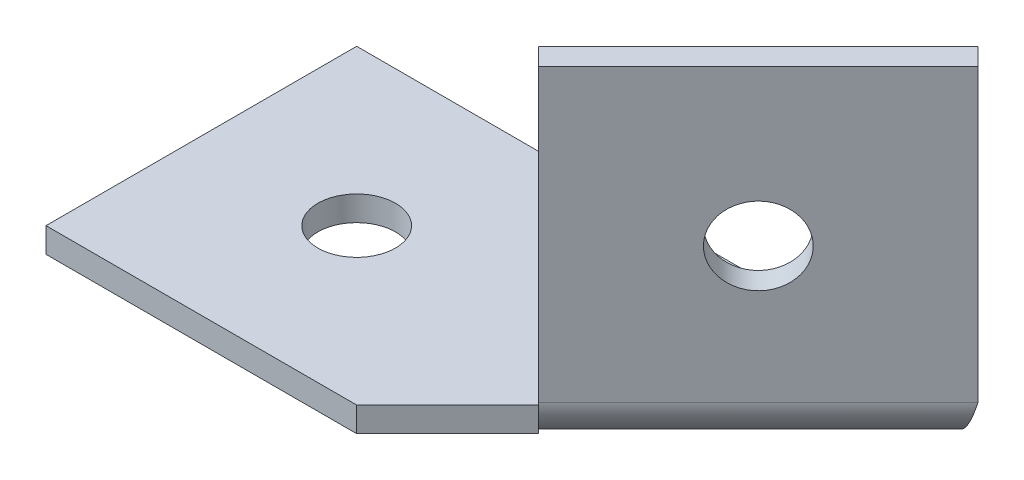
ISO-10303-21;
HEADER;
FILE_DESCRIPTION(('STEP AP214'),'2;1');
FILE_NAME('part.step','',(''),(''),'','','');
FILE_SCHEMA(('AUTOMOTIVE_DESIGN { 1 0 10303 214 1 1 1 1 }'));
ENDSEC;
DATA;
#1=APPLICATION_CONTEXT('core data for automotive mechanical design processes');
#2=APPLICATION_PROTOCOL_DEFINITION('international standard','automotive_design',2000,#1);
#3=PRODUCT_CONTEXT('',#1,'mechanical');
#4=PRODUCT('Part','Part','',(#3));
#5=PRODUCT_RELATED_PRODUCT_CATEGORY('part','',(#4));
#6=PRODUCT_DEFINITION_FORMATION('','',#4);
#7=PRODUCT_DEFINITION_CONTEXT('part definition',#1,'design');
#8=PRODUCT_DEFINITION('design','',#6,#7);
#9=PRODUCT_DEFINITION_SHAPE('','',#8);
#10=(LENGTH_UNIT() NAMED_UNIT(*) SI_UNIT(.MILLI.,.METRE.));
#11=(NAMED_UNIT(*) PLANE_ANGLE_UNIT() SI_UNIT($,.RADIAN.));
#12=(NAMED_UNIT(*) SI_UNIT($,.STERADIAN.) SOLID_ANGLE_UNIT());
#13=UNCERTAINTY_MEASURE_WITH_UNIT(LENGTH_MEASURE(1.E-05),#10,'distance_accuracy_value','');
#14=(GEOMETRIC_REPRESENTATION_CONTEXT(3) GLOBAL_UNCERTAINTY_ASSIGNED_CONTEXT((#13)) GLOBAL_UNIT_ASSIGNED_CONTEXT((#10,
#11,#12)) REPRESENTATION_CONTEXT('',''));
#15=CARTESIAN_POINT('',(0.,0.,0.));
#16=DIRECTION('',(0.,0.,1.));
#17=DIRECTION('',(1.,0.,0.));
#18=AXIS2_PLACEMENT_3D('',#15,#16,#17);
#19=CARTESIAN_POINT('',(9.95983876416214,0.,3.24411001162404));
#20=DIRECTION('',(0.707106781186547,0.,-0.707106781186547));
#21=DIRECTION('',(-0.707106781186548,0.,-0.707106781186548));
#22=AXIS2_PLACEMENT_3D('',#19,#20,#21);
#23=PLANE('',#22);
#24=DIRECTION('',(-0.707106781186548,0.,-0.707106781186548));
#25=VECTOR('',#24,1.);
#26=CARTESIAN_POINT('',(3.35786437626905,-1.6,-3.35786437626905));
#27=LINE('',#26,#25);
#28=CARTESIAN_POINT('',(10.8578643762691,-1.6,4.14213562373095));
#29=VERTEX_POINT('',#28);
#30=CARTESIAN_POINT('',(9.95983876416214,-1.6,3.24411001162404));
#31=VERTEX_POINT('',#30);
#32=EDGE_CURVE('E280',#29,#31,#27,.T.);
#33=ORIENTED_EDGE('',*,*,#32,.T.);
#34=CARTESIAN_POINT('',(9.95983876416214,1.27,3.24411001162404));
#35=DIRECTION('',(0.707106781186548,0.,-0.707106781186548));
#36=DIRECTION('',(-0.707106781186548,0.,-0.707106781186548));
#37=AXIS2_PLACEMENT_3D('',#34,#35,#36);
#38=CIRCLE('',#37,2.87);
#39=CARTESIAN_POINT('',(10.8578643762691,-1.30371327074327,4.14213562373095));
#40=VERTEX_POINT('',#39);
#41=EDGE_CURVE('E56',#31,#40,#38,.F.);
#42=ORIENTED_EDGE('',*,*,#41,.T.);
#43=DIRECTION('',(0.,-1.,0.));
#44=VECTOR('',#43,1.);
#45=CARTESIAN_POINT('',(10.8578643762691,0.,4.14213562373095));
#46=LINE('',#45,#44);
#47=EDGE_CURVE('E285',#40,#29,#46,.T.);
#48=ORIENTED_EDGE('',*,*,#47,.T.);
#49=EDGE_LOOP('',(#33,#42,#48));
#50=FACE_BOUND('',#49,.T.);
#51=ADVANCED_FACE('F39',(#50),#23,.T.);
#52=CARTESIAN_POINT('',(-15.,-1.6,-10.));
#53=DIRECTION('',(0.,0.,-1.));
#54=DIRECTION('',(-1.,0.,0.));
#55=AXIS2_PLACEMENT_3D('',#52,#53,#54);
#56=PLANE('',#55);
#57=DIRECTION('',(-1.,0.,0.));
#58=VECTOR('',#57,1.);
#59=CARTESIAN_POINT('',(-15.,0.,-10.));
#60=LINE('',#59,#58);
#61=CARTESIAN_POINT('',(23.2039487757862,0.,-10.));
#62=VERTEX_POINT('',#61);
#63=CARTESIAN_POINT('',(-15.,0.,-10.));
#64=VERTEX_POINT('',#63);
#65=EDGE_CURVE('E257',#62,#64,#60,.T.);
#66=ORIENTED_EDGE('',*,*,#65,.F.);
#67=DIRECTION('',(0.,-1.,0.));
#68=VECTOR('',#67,1.);
#69=CARTESIAN_POINT('',(23.2039487757862,0.,-10.));
#70=LINE('',#69,#68);
#71=CARTESIAN_POINT('',(23.2039487757862,-1.6,-10.));
#72=VERTEX_POINT('',#71);
#73=EDGE_CURVE('E176',#62,#72,#70,.T.);
#74=ORIENTED_EDGE('',*,*,#73,.T.);
#75=DIRECTION('',(-1.,0.,0.));
#76=VECTOR('',#75,1.);
#77=CARTESIAN_POINT('',(-15.,-1.6,-10.));
#78=LINE('',#77,#76);
#79=CARTESIAN_POINT('',(-15.,-1.6,-10.));
#80=VERTEX_POINT('',#79);
#81=EDGE_CURVE('E265',#72,#80,#78,.T.);
#82=ORIENTED_EDGE('',*,*,#81,.T.);
#83=DIRECTION('',(0.,1.,0.));
#84=VECTOR('',#83,1.);
#85=CARTESIAN_POINT('',(-15.,-1.6,-10.));
#86=LINE('',#85,#84);
#87=EDGE_CURVE('E11',#80,#64,#86,.T.);
#88=ORIENTED_EDGE('',*,*,#87,.T.);
#89=EDGE_LOOP('',(#66,#74,#82,#88));
#90=FACE_BOUND('',#89,.T.);
#91=ADVANCED_FACE('F221',(#90),#56,.T.);
#92=CARTESIAN_POINT('',(5.,-1.6,10.));
#93=DIRECTION('',(0.707106781186548,0.,0.707106781186548));
#94=DIRECTION('',(0.707106781186548,0.,-0.707106781186548));
#95=AXIS2_PLACEMENT_3D('',#92,#93,#94);
#96=PLANE('',#95);
#97=DIRECTION('',(0.707106781186548,0.,-0.707106781186547));
#98=VECTOR('',#97,1.);
#99=CARTESIAN_POINT('',(5.,-1.6,10.));
#100=LINE('',#99,#98);
#101=CARTESIAN_POINT('',(5.,-1.6,10.));
#102=VERTEX_POINT('',#101);
#103=EDGE_CURVE('E271',#102,#29,#100,.T.);
#104=ORIENTED_EDGE('',*,*,#103,.T.);
#105=ORIENTED_EDGE('',*,*,#47,.F.);
#106=CARTESIAN_POINT('',(10.8578643762691,0.,4.14213562373095));
#107=VERTEX_POINT('',#106);
#108=EDGE_CURVE('E283',#107,#40,#46,.T.);
#109=ORIENTED_EDGE('',*,*,#108,.F.);
#110=DIRECTION('',(0.707106781186548,0.,-0.707106781186547));
#111=VECTOR('',#110,1.);
#112=CARTESIAN_POINT('',(5.,0.,10.));
#113=LINE('',#112,#111);
#114=CARTESIAN_POINT('',(5.,0.,10.));
#115=VERTEX_POINT('',#114);
#116=EDGE_CURVE('E252',#115,#107,#113,.T.);
#117=ORIENTED_EDGE('',*,*,#116,.F.);
#118=DIRECTION('',(0.,1.,0.));
#119=VECTOR('',#118,1.);
#120=CARTESIAN_POINT('',(5.,-1.6,10.));
#121=LINE('',#120,#119);
#122=EDGE_CURVE('E48',#102,#115,#121,.T.);
#123=ORIENTED_EDGE('',*,*,#122,.F.);
#124=EDGE_LOOP('',(#104,#105,#109,#117,#123));
#125=FACE_BOUND('',#124,.T.);
#126=ADVANCED_FACE('F225',(#125),#96,.T.);
#127=CARTESIAN_POINT('',(0.,-1.6,0.));
#128=DIRECTION('',(0.,1.,0.));
#129=DIRECTION('',(0.,0.,1.));
#130=AXIS2_PLACEMENT_3D('',#127,#128,#129);
#131=PLANE('',#130);
#132=CARTESIAN_POINT('',(-5.,-1.6,0.));
#133=DIRECTION('',(0.,1.,0.));
#134=DIRECTION('',(0.,0.,1.));
#135=AXIS2_PLACEMENT_3D('',#132,#133,#134);
#136=CIRCLE('',#135,2.5);
#137=CARTESIAN_POINT('',(-5.,-1.6,2.5));
#138=VERTEX_POINT('',#137);
#139=EDGE_CURVE('E259',#138,#138,#136,.T.);
#140=ORIENTED_EDGE('',*,*,#139,.T.);
#141=EDGE_LOOP('',(#140));
#142=FACE_BOUND('',#141,.T.);
#143=DIRECTION('',(0.707106781186548,0.,-0.707106781186548));
#144=VECTOR('',#143,1.);
#145=CARTESIAN_POINT('',(24.1019743878931,-1.6,-10.8980256121069));
#146=LINE('',#145,#144);
#147=EDGE_CURVE('E130',#72,#31,#146,.F.);
#148=ORIENTED_EDGE('',*,*,#147,.T.);
#149=ORIENTED_EDGE('',*,*,#32,.F.);
#150=ORIENTED_EDGE('',*,*,#103,.F.);
#151=DIRECTION('',(1.,0.,0.));
#152=VECTOR('',#151,1.);
#153=CARTESIAN_POINT('',(-15.,-1.6,10.));
#154=LINE('',#153,#152);
#155=CARTESIAN_POINT('',(-15.,-1.6,10.));
#156=VERTEX_POINT('',#155);
#157=EDGE_CURVE('E274',#156,#102,#154,.T.);
#158=ORIENTED_EDGE('',*,*,#157,.F.);
#159=DIRECTION('',(0.,0.,1.));
#160=VECTOR('',#159,1.);
#161=CARTESIAN_POINT('',(-15.,-1.6,-10.));
#162=LINE('',#161,#160);
#163=EDGE_CURVE('E269',#80,#156,#162,.T.);
#164=ORIENTED_EDGE('',*,*,#163,.F.);
#165=ORIENTED_EDGE('',*,*,#81,.F.);
#166=EDGE_LOOP('',(#148,#149,#150,#158,#164,#165));
#167=FACE_BOUND('',#166,.T.);
#168=ADVANCED_FACE('F229',(#142,#167),#131,.F.);
#169=CARTESIAN_POINT('',(0.,0.,0.));
#170=DIRECTION('',(0.,1.,0.));
#171=DIRECTION('',(0.,0.,1.));
#172=AXIS2_PLACEMENT_3D('',#169,#170,#171);
#173=PLANE('',#172);
#174=CARTESIAN_POINT('',(-5.,0.,0.));
#175=DIRECTION('',(0.,1.,0.));
#176=DIRECTION('',(0.,0.,1.));
#177=AXIS2_PLACEMENT_3D('',#174,#175,#176);
#178=CIRCLE('',#177,2.5);
#179=CARTESIAN_POINT('',(-5.,0.,2.5));
#180=VERTEX_POINT('',#179);
#181=EDGE_CURVE('E262',#180,#180,#178,.T.);
#182=ORIENTED_EDGE('',*,*,#181,.F.);
#183=EDGE_LOOP('',(#182));
#184=FACE_BOUND('',#183,.T.);
#185=DIRECTION('',(0.707106781186547,0.,0.707106781186547));
#186=VECTOR('',#185,1.);
#187=CARTESIAN_POINT('',(9.95983876416214,0.,3.24411001162404));
#188=LINE('',#187,#186);
#189=CARTESIAN_POINT('',(9.95983876416214,0.,3.24411001162404));
#190=VERTEX_POINT('',#189);
#191=EDGE_CURVE('E64',#190,#107,#188,.T.);
#192=ORIENTED_EDGE('',*,*,#191,.F.);
#193=DIRECTION('',(0.707106781186548,0.,-0.707106781186548));
#194=VECTOR('',#193,1.);
#195=CARTESIAN_POINT('',(24.1019743878931,0.,-10.8980256121069));
#196=LINE('',#195,#194);
#197=EDGE_CURVE('E180',#62,#190,#196,.F.);
#198=ORIENTED_EDGE('',*,*,#197,.F.);
#199=ORIENTED_EDGE('',*,*,#65,.T.);
#200=DIRECTION('',(0.,0.,1.));
#201=VECTOR('',#200,1.);
#202=CARTESIAN_POINT('',(-15.,0.,-10.));
#203=LINE('',#202,#201);
#204=CARTESIAN_POINT('',(-15.,0.,10.));
#205=VERTEX_POINT('',#204);
#206=EDGE_CURVE('E253',#64,#205,#203,.T.);
#207=ORIENTED_EDGE('',*,*,#206,.T.);
#208=DIRECTION('',(1.,0.,0.));
#209=VECTOR('',#208,1.);
#210=CARTESIAN_POINT('',(-15.,0.,10.));
#211=LINE('',#210,#209);
#212=EDGE_CURVE('E247',#205,#115,#211,.T.);
#213=ORIENTED_EDGE('',*,*,#212,.T.);
#214=ORIENTED_EDGE('',*,*,#116,.T.);
#215=EDGE_LOOP('',(#192,#198,#199,#207,#213,#214));
#216=FACE_BOUND('',#215,.T.);
#217=ADVANCED_FACE('F232',(#184,#216),#173,.T.);
#218=CARTESIAN_POINT('',(-15.,-1.6,-10.));
#219=DIRECTION('',(-1.,0.,0.));
#220=DIRECTION('',(0.,0.,1.));
#221=AXIS2_PLACEMENT_3D('',#218,#219,#220);
#222=PLANE('',#221);
#223=ORIENTED_EDGE('',*,*,#206,.F.);
#224=ORIENTED_EDGE('',*,*,#87,.F.);
#225=ORIENTED_EDGE('',*,*,#163,.T.);
#226=DIRECTION('',(0.,1.,0.));
#227=VECTOR('',#226,1.);
#228=CARTESIAN_POINT('',(-15.,-1.6,10.));
#229=LINE('',#228,#227);
#230=EDGE_CURVE('E43',#156,#205,#229,.T.);
#231=ORIENTED_EDGE('',*,*,#230,.T.);
#232=EDGE_LOOP('',(#223,#224,#225,#231));
#233=FACE_BOUND('',#232,.T.);
#234=ADVANCED_FACE('F41',(#233),#222,.T.);
#235=CARTESIAN_POINT('',(-15.,-1.6,10.));
#236=DIRECTION('',(0.,0.,1.));
#237=DIRECTION('',(1.,0.,0.));
#238=AXIS2_PLACEMENT_3D('',#235,#236,#237);
#239=PLANE('',#238);
#240=ORIENTED_EDGE('',*,*,#212,.F.);
#241=ORIENTED_EDGE('',*,*,#230,.F.);
#242=ORIENTED_EDGE('',*,*,#157,.T.);
#243=ORIENTED_EDGE('',*,*,#122,.T.);
#244=EDGE_LOOP('',(#240,#241,#242,#243));
#245=FACE_BOUND('',#244,.T.);
#246=ADVANCED_FACE('F217',(#245),#239,.T.);
#247=CARTESIAN_POINT('',(-5.,-1.6,0.));
#248=DIRECTION('',(0.,1.,0.));
#249=DIRECTION('',(0.,0.,1.));
#250=AXIS2_PLACEMENT_3D('',#247,#248,#249);
#251=CYLINDRICAL_SURFACE('',#250,2.5);
#252=ORIENTED_EDGE('',*,*,#139,.F.);
#253=EDGE_LOOP('',(#252));
#254=FACE_BOUND('',#253,.T.);
#255=ORIENTED_EDGE('',*,*,#181,.T.);
#256=EDGE_LOOP('',(#255));
#257=FACE_BOUND('',#256,.T.);
#258=ADVANCED_FACE('F211',(#254,#257),#251,.F.);
#259=CARTESIAN_POINT('',(9.95983876416214,1.27,3.24411001162404));
#260=DIRECTION('',(-0.707106781186548,0.,0.707106781186548));
#261=DIRECTION('',(0.707106781186548,0.,0.707106781186548));
#262=AXIS2_PLACEMENT_3D('',#259,#260,#261);
#263=PLANE('',#262);
#264=ORIENTED_EDGE('',*,*,#191,.T.);
#265=ORIENTED_EDGE('',*,*,#108,.T.);
#266=CARTESIAN_POINT('',(11.9892352261675,1.26999999999999,5.27350647362943));
#267=VERTEX_POINT('',#266);
#268=EDGE_CURVE('E177',#40,#267,#38,.F.);
#269=ORIENTED_EDGE('',*,*,#268,.T.);
#270=DIRECTION('',(0.707106781186548,0.,0.707106781186548));
#271=VECTOR('',#270,1.);
#272=CARTESIAN_POINT('',(10.8578643762691,1.26999999999999,4.14213562373095));
#273=LINE('',#272,#271);
#274=CARTESIAN_POINT('',(10.8578643762691,1.26999999999999,4.14213562373095));
#275=VERTEX_POINT('',#274);
#276=EDGE_CURVE('E291',#275,#267,#273,.T.);
#277=ORIENTED_EDGE('',*,*,#276,.F.);
#278=CARTESIAN_POINT('',(9.95983876416214,1.27,3.24411001162404));
#279=DIRECTION('',(0.707106781186548,0.,-0.707106781186548));
#280=DIRECTION('',(-0.707106781186548,0.,-0.707106781186548));
#281=AXIS2_PLACEMENT_3D('',#278,#279,#280);
#282=CIRCLE('',#281,1.27);
#283=EDGE_CURVE('E133',#190,#275,#282,.F.);
#284=ORIENTED_EDGE('',*,*,#283,.F.);
#285=EDGE_LOOP('',(#264,#265,#269,#277,#284));
#286=FACE_BOUND('',#285,.T.);
#287=ADVANCED_FACE('F209',(#286),#263,.T.);
#288=CARTESIAN_POINT('',(26.1426845583975,1.26999999999999,-8.85731544160254));
#289=CARTESIAN_POINT('',(26.0678365611497,0.892160314891756,-8.78246744435475));
#290=CARTESIAN_POINT('',(25.9398993996123,0.51459560573911,-8.76075872968536));
#291=CARTESIAN_POINT('',(25.5857772867536,-0.183444377350421,-8.8155389718418));
#292=CARTESIAN_POINT('',(25.3596853078123,-0.50358183384761,-8.89196001543195));
#293=CARTESIAN_POINT('',(24.832237855867,-1.03783850716115,-9.12006559667497));
#294=CARTESIAN_POINT('',(24.5310310217904,-1.25174751679039,-9.27160149540037));
#295=CARTESIAN_POINT('',(23.8877712808573,-1.54088514486476,-9.61551936563117));
#296=CARTESIAN_POINT('',(23.5459697765754,-1.616,-9.80767499370637));
#297=CARTESIAN_POINT('',(23.2039487757862,-1.616,-10.));
#298=CARTESIAN_POINT('',(26.1313708498985,1.26999999999999,-8.86862915010153));
#299=CARTESIAN_POINT('',(26.056522881643,0.89425512424837,-8.79378118184603));
#300=CARTESIAN_POINT('',(25.9288801566625,0.518783571888858,-8.77177797263517));
#301=CARTESIAN_POINT('',(25.5758915222654,-0.175386473664487,-8.82542473633002));
#302=CARTESIAN_POINT('',(25.3506381102611,-0.493749086328011,-8.90100721298315));
#303=CARTESIAN_POINT('',(24.8252850534182,-1.02504383768278,-9.12701839912378));
#304=CARTESIAN_POINT('',(24.5253332234519,-1.23776693457672,-9.27729929373885));
#305=CARTESIAN_POINT('',(23.8848099415934,-1.52530158203807,-9.61848070489504));
#306=CARTESIAN_POINT('',(23.5444884936817,-1.6,-9.80915621861543));
#307=CARTESIAN_POINT('',(23.2039487757862,-1.6,-10.));
#308=CARTESIAN_POINT('',(25.,1.27,-10.));
#309=CARTESIAN_POINT('',(24.9251549309741,1.10373605990976,-9.9251549309741));
#310=CARTESIAN_POINT('',(24.8269558616824,0.937580186863712,-9.87370226761529));
#311=CARTESIAN_POINT('',(24.5873150734433,0.630403894928956,-9.81400118515209));
#312=CARTESIAN_POINT('',(24.4459183551414,0.489525665631857,-9.80572696810281));
#313=CARTESIAN_POINT('',(24.1300048085378,0.254423110154312,-9.82229864400411));
#314=CARTESIAN_POINT('',(23.9555533896047,0.160291286790093,-9.84707912758607));
#315=CARTESIAN_POINT('',(23.5886760152068,0.0330547006312409,-9.91461463128172));
#316=CARTESIAN_POINT('',(23.3963602043167,0.,-9.95727870952131));
#317=CARTESIAN_POINT('',(23.2039487757862,0.,-10.));
#318=CARTESIAN_POINT('',(24.988573154416,1.27,-10.011426845584));
#319=CARTESIAN_POINT('',(24.9137281146724,1.10585181735994,-9.93658180584029));
#320=CARTESIAN_POINT('',(24.8158264263031,0.941810032674958,-9.88483170299459));
#321=CARTESIAN_POINT('',(24.5773304513102,0.63854237765175,-9.82398580728519));
#322=CARTESIAN_POINT('',(24.4367806856147,0.499456740626652,-9.81486463762952));
#323=CARTESIAN_POINT('',(24.1229824780645,0.267345726327466,-9.82932097447741));
#324=CARTESIAN_POINT('',(23.9497986132829,0.174411674825898,-9.85283390390793));
#325=CARTESIAN_POINT('',(23.5856850625503,0.0487940990862009,-9.91760558393823));
#326=CARTESIAN_POINT('',(23.3948641085941,0.0161600000000023,-9.95877474667946));
#327=CARTESIAN_POINT('',(23.2039487757862,0.0161600000000026,-10.));
#328=B_SPLINE_SURFACE_WITH_KNOTS('',1,3,((#288,#289,#290,#291,#292,#293,#294,#295,#296,#297),
(#298,#299,#300,#301,#302,#303,#304,#305,#306,#307),(#308,#309,#310,#311,#312,#313,#314,#315,
#316,#317),(#318,#319,#320,#321,#322,#323,#324,#325,#326,#327)),.UNSPECIFIED.,.F.,.F.,.F.,(2,1,
1,2),(4,2,2,2,4),(-0.01,0.,1.,1.0101),(0.,0.25,0.5,0.75,1.),.UNSPECIFIED.);
#329=CARTESIAN_POINT('',(25.,1.27,-10.));
#330=CARTESIAN_POINT('',(24.9794457157982,1.22432779684599,-9.97943207975731));
#331=CARTESIAN_POINT('',(24.9571376153336,1.17865770544456,-9.96062154135037));
#332=CARTESIAN_POINT('',(24.9090622230194,1.08784772906659,-9.92646226345873));
#333=CARTESIAN_POINT('',(24.8832950035817,1.04270783301265,-9.91111345152556));
#334=CARTESIAN_POINT('',(24.8283898465385,0.953548685267265,-9.88384411707349));
#335=CARTESIAN_POINT('',(24.7992569837026,0.909527865405676,-9.871918525195));
#336=CARTESIAN_POINT('',(24.7377089011005,0.823064073309927,-9.85136290278667));
#337=CARTESIAN_POINT('',(24.7052940060129,0.780620945567686,-9.8427325466743));
#338=CARTESIAN_POINT('',(24.6080696158124,0.662190042368516,-9.8225815464238));
#339=CARTESIAN_POINT('',(24.5393345115583,0.588676680368536,-9.81493761384507));
#340=CARTESIAN_POINT('',(24.3922044657137,0.451796637401782,-9.8093867467967));
#341=CARTESIAN_POINT('',(24.3138151306375,0.388424116042657,-9.81147418673117));
#342=CARTESIAN_POINT('',(24.148927662593,0.274253793566049,-9.82375878455755));
#343=CARTESIAN_POINT('',(24.0624300117423,0.223455245457784,-9.83395546054673));
#344=CARTESIAN_POINT('',(23.883226845443,0.136460666615483,-9.86052775410516));
#345=CARTESIAN_POINT('',(23.7905196089405,0.100268703944408,-9.87690509058873));
#346=CARTESIAN_POINT('',(23.6157116167698,0.0482894980871594,-9.91082866843306));
#347=CARTESIAN_POINT('',(23.5341760736405,0.030218274345681,-9.92780650538195));
#348=CARTESIAN_POINT('',(23.4108664319563,0.0121092536522786,-9.9543412556854));
#349=CARTESIAN_POINT('',(23.3695978743683,0.00757255145035067,-9.96336362769673));
#350=CARTESIAN_POINT('',(23.2868734095944,0.00151705875710757,-9.98158995089415));
#351=CARTESIAN_POINT('',(23.245417475617,-1.2855434784846E-06,-9.99079392872318));
#352=CARTESIAN_POINT('',(23.2039487757862,0.,-10.));
#353=B_SPLINE_CURVE_WITH_KNOTS('',3,(#329,#330,#331,#332,#333,#334,#335,#336,#337,#338,#339,
#340,#341,#342,#343,#344,#345,#346,#347,#348,#349,#350,#351,#352),.UNSPECIFIED.,.F.,.F.,(4,2,2,
2,2,2,2,2,2,2,2,4),(0.,0.162367301932302,0.324731205457653,0.48685341312298,0.64895959831588,
0.950196690891846,1.25125966332813,1.55230474601191,1.85343361464476,2.10818921190071,
2.23555251334032,2.36293464094355),.UNSPECIFIED.);
#354=CARTESIAN_POINT('',(25.,1.27,-10.));
#355=VERTEX_POINT('',#354);
#356=EDGE_CURVE('E140',#355,#62,#353,.T.);
#357=DIRECTION('',(0.707106781186548,0.,0.707106781186548));
#358=VECTOR('',#357,1.);
#359=CARTESIAN_POINT('',(25.,1.27,-10.));
#360=LINE('',#359,#358);
#361=CARTESIAN_POINT('',(26.1313708498985,1.26999999999999,-8.86862915010152));
#362=VERTEX_POINT('',#361);
#363=EDGE_CURVE('E137',#355,#362,#360,.T.);
#364=CARTESIAN_POINT('',(26.1313708498985,1.26999999999999,-8.86862915010153));
#365=CARTESIAN_POINT('',(26.1146679011241,1.18612098918057,-8.85191336233404));
#366=CARTESIAN_POINT('',(26.0953529044557,1.10224582399755,-8.83781145690156));
#367=CARTESIAN_POINT('',(26.0515479860515,0.935143081672331,-8.81478574713821));
#368=CARTESIAN_POINT('',(26.0270583331944,0.85191547111564,-8.8058616738539));
#369=CARTESIAN_POINT('',(25.9729726739047,0.686803442726031,-8.79314521039306));
#370=CARTESIAN_POINT('',(25.9433806737856,0.604918025843845,-8.78934881451916));
#371=CARTESIAN_POINT('',(25.8791933727098,0.443078117009515,-8.78676601515012));
#372=CARTESIAN_POINT('',(25.8445981369767,0.36312359990146,-8.78797954634983));
#373=CARTESIAN_POINT('',(25.7334382981449,0.126973534141726,-8.79895958129342));
#374=CARTESIAN_POINT('',(25.6494855290853,-0.0255516725051069,-8.81606236566385));
#375=CARTESIAN_POINT('',(25.4636099281886,-0.315683209119465,-8.86829719414533));
#376=CARTESIAN_POINT('',(25.3616912039831,-0.453292937686322,-8.90342512059317));
#377=CARTESIAN_POINT('',(25.1419276381073,-0.709520583994881,-8.98959159445194));
#378=CARTESIAN_POINT('',(25.0240836083806,-0.828139469301992,-9.04062933088245));
#379=CARTESIAN_POINT('',(24.7750234407033,-1.04276813887826,-9.15606496790491));
#380=CARTESIAN_POINT('',(24.6438028842566,-1.13877041759735,-9.22046729037159));
#381=CARTESIAN_POINT('',(24.3709890645342,-1.30520535482544,-9.35962055205355));
#382=CARTESIAN_POINT('',(24.2293920992865,-1.37562883373482,-9.43437519319275));
#383=CARTESIAN_POINT('',(23.9392418142602,-1.48864497839261,-9.59088143779829));
#384=CARTESIAN_POINT('',(23.7906959531454,-1.53126678267306,-9.67262561363423));
#385=CARTESIAN_POINT('',(23.5682412431027,-1.57289870417191,-9.79620130167937));
#386=CARTESIAN_POINT('',(23.4955551192526,-1.58306303717776,-9.8367588045818));
#387=CARTESIAN_POINT('',(23.3499068580748,-1.59660726396887,-9.91820516017963));
#388=CARTESIAN_POINT('',(23.2769454326988,-1.59999907976421,-9.95909330316333));
#389=CARTESIAN_POINT('',(23.2039487757862,-1.6,-10.));
#390=B_SPLINE_CURVE_WITH_KNOTS('',3,(#364,#365,#366,#367,#368,#369,#370,#371,#372,#373,#374,
#375,#376,#377,#378,#379,#380,#381,#382,#383,#384,#385,#386,#387,#388,#389),.UNSPECIFIED.,.F.,
.F.,(4,2,2,2,2,2,2,2,2,2,2,2,4),(0.,0.261347103696602,0.522680630959639,0.783809888420262,
1.04493574203159,1.56705273281083,2.08905050425551,2.61102167194071,3.13316581780048,
3.65549716358532,4.17728017806128,4.42860669953635,4.67949040659082),.UNSPECIFIED.);
#391=EDGE_CURVE('E122',#362,#72,#390,.T.);
#392=ORIENTED_EDGE('',*,*,#356,.F.);
#393=ORIENTED_EDGE('',*,*,#363,.T.);
#394=ORIENTED_EDGE('',*,*,#391,.T.);
#395=ORIENTED_EDGE('',*,*,#73,.F.);
#396=EDGE_LOOP('',(#392,#393,#394,#395));
#397=FACE_BOUND('',#396,.T.);
#398=ADVANCED_FACE('F138',(#397),#328,.F.);
#399=CARTESIAN_POINT('',(24.1019743878931,1.27,-10.8980256121069));
#400=DIRECTION('',(0.707106781186548,0.,-0.707106781186548));
#401=DIRECTION('',(0.707106781186548,0.,0.707106781186548));
#402=AXIS2_PLACEMENT_3D('',#399,#400,#401);
#403=CYLINDRICAL_SURFACE('',#402,2.87);
#404=ORIENTED_EDGE('',*,*,#147,.F.);
#405=ORIENTED_EDGE('',*,*,#391,.F.);
#406=DIRECTION('',(-0.707106781186548,0.,0.707106781186547));
#407=VECTOR('',#406,1.);
#408=CARTESIAN_POINT('',(8.63137084989848,1.26999999999999,8.63137084989848));
#409=LINE('',#408,#407);
#410=EDGE_CURVE('E127',#362,#267,#409,.T.);
#411=ORIENTED_EDGE('',*,*,#410,.T.);
#412=ORIENTED_EDGE('',*,*,#268,.F.);
#413=ORIENTED_EDGE('',*,*,#41,.F.);
#414=EDGE_LOOP('',(#404,#405,#411,#412,#413));
#415=FACE_BOUND('',#414,.T.);
#416=ADVANCED_FACE('F124',(#415),#403,.T.);
#417=CARTESIAN_POINT('',(24.1019743878931,1.27,-10.8980256121069));
#418=DIRECTION('',(0.707106781186548,0.,-0.707106781186548));
#419=DIRECTION('',(0.707106781186548,0.,0.707106781186548));
#420=AXIS2_PLACEMENT_3D('',#417,#418,#419);
#421=CYLINDRICAL_SURFACE('',#420,1.27);
#422=ORIENTED_EDGE('',*,*,#197,.T.);
#423=ORIENTED_EDGE('',*,*,#283,.T.);
#424=DIRECTION('',(0.707106781186548,0.,-0.707106781186548));
#425=VECTOR('',#424,1.);
#426=CARTESIAN_POINT('',(10.8578643762691,1.26999999999999,4.14213562373095));
#427=LINE('',#426,#425);
#428=EDGE_CURVE('E144',#275,#355,#427,.T.);
#429=ORIENTED_EDGE('',*,*,#428,.T.);
#430=ORIENTED_EDGE('',*,*,#356,.T.);
#431=EDGE_LOOP('',(#422,#423,#429,#430));
#432=FACE_BOUND('',#431,.T.);
#433=ADVANCED_FACE('F204',(#432),#421,.F.);
#434=CARTESIAN_POINT('',(26.1313708498985,20.,-8.86862915010148));
#435=DIRECTION('',(-0.707106781186548,0.,0.707106781186548));
#436=DIRECTION('',(0.707106781186548,0.,0.707106781186548));
#437=AXIS2_PLACEMENT_3D('',#434,#435,#436);
#438=PLANE('',#437);
#439=ORIENTED_EDGE('',*,*,#363,.F.);
#440=DIRECTION('',(0.,1.,0.));
#441=VECTOR('',#440,1.);
#442=CARTESIAN_POINT('',(25.0000000000001,20.,-9.99999999999995));
#443=LINE('',#442,#441);
#444=CARTESIAN_POINT('',(25.0000000000001,20.,-9.99999999999995));
#445=VERTEX_POINT('',#444);
#446=EDGE_CURVE('E153',#355,#445,#443,.T.);
#447=ORIENTED_EDGE('',*,*,#446,.T.);
#448=DIRECTION('',(-0.707106781186548,0.,-0.707106781186548));
#449=VECTOR('',#448,1.);
#450=CARTESIAN_POINT('',(26.1313708498985,20.,-8.86862915010148));
#451=LINE('',#450,#449);
#452=CARTESIAN_POINT('',(26.1313708498985,20.,-8.86862915010148));
#453=VERTEX_POINT('',#452);
#454=EDGE_CURVE('E157',#453,#445,#451,.T.);
#455=ORIENTED_EDGE('',*,*,#454,.F.);
#456=DIRECTION('',(0.,1.,0.));
#457=VECTOR('',#456,1.);
#458=CARTESIAN_POINT('',(26.1313708498985,20.,-8.86862915010148));
#459=LINE('',#458,#457);
#460=EDGE_CURVE('E149',#362,#453,#459,.T.);
#461=ORIENTED_EDGE('',*,*,#460,.F.);
#462=EDGE_LOOP('',(#439,#447,#455,#461));
#463=FACE_BOUND('',#462,.T.);
#464=ADVANCED_FACE('F155',(#463),#438,.F.);
#465=CARTESIAN_POINT('',(11.9892352261675,0.,5.27350647362942));
#466=DIRECTION('',(0.707106781186548,0.,-0.707106781186548));
#467=DIRECTION('',(-0.707106781186548,0.,-0.707106781186548));
#468=AXIS2_PLACEMENT_3D('',#465,#466,#467);
#469=PLANE('',#468);
#470=ORIENTED_EDGE('',*,*,#276,.T.);
#471=DIRECTION('',(0.,-1.,0.));
#472=VECTOR('',#471,1.);
#473=CARTESIAN_POINT('',(11.9892352261675,0.,5.27350647362942));
#474=LINE('',#473,#472);
#475=CARTESIAN_POINT('',(11.9892352261676,20.,5.27350647362947));
#476=VERTEX_POINT('',#475);
#477=EDGE_CURVE('E152',#476,#267,#474,.T.);
#478=ORIENTED_EDGE('',*,*,#477,.F.);
#479=DIRECTION('',(-0.707106781186548,0.,-0.707106781186548));
#480=VECTOR('',#479,1.);
#481=CARTESIAN_POINT('',(11.9892352261676,20.,5.27350647362947));
#482=LINE('',#481,#480);
#483=CARTESIAN_POINT('',(10.8578643762691,20.,4.142135623731));
#484=VERTEX_POINT('',#483);
#485=EDGE_CURVE('E169',#476,#484,#482,.T.);
#486=ORIENTED_EDGE('',*,*,#485,.T.);
#487=DIRECTION('',(0.,-1.,0.));
#488=VECTOR('',#487,1.);
#489=CARTESIAN_POINT('',(10.8578643762691,0.,4.14213562373095));
#490=LINE('',#489,#488);
#491=EDGE_CURVE('E160',#484,#275,#490,.T.);
#492=ORIENTED_EDGE('',*,*,#491,.T.);
#493=EDGE_LOOP('',(#470,#478,#486,#492));
#494=FACE_BOUND('',#493,.T.);
#495=ADVANCED_FACE('F300',(#494),#469,.F.);
#496=CARTESIAN_POINT('',(8.63137084989848,0.,8.63137084989848));
#497=DIRECTION('',(-0.707106781186547,0.,-0.707106781186548));
#498=DIRECTION('',(-0.707106781186548,0.,0.707106781186547));
#499=AXIS2_PLACEMENT_3D('',#496,#497,#498);
#500=PLANE('',#499);
#501=CARTESIAN_POINT('',(19.0603030380331,9.99999999999996,-1.79756133823604));
#502=DIRECTION('',(-0.707106781186547,0.,-0.707106781186548));
#503=DIRECTION('',(-0.707106781186548,0.,0.707106781186547));
#504=AXIS2_PLACEMENT_3D('',#501,#502,#503);
#505=CIRCLE('',#504,2.5);
#506=CARTESIAN_POINT('',(17.2925360850667,9.99999999999996,-0.029794385269675));
#507=VERTEX_POINT('',#506);
#508=EDGE_CURVE('E293',#507,#507,#505,.T.);
#509=ORIENTED_EDGE('',*,*,#508,.T.);
#510=EDGE_LOOP('',(#509));
#511=FACE_BOUND('',#510,.T.);
#512=ORIENTED_EDGE('',*,*,#410,.F.);
#513=ORIENTED_EDGE('',*,*,#460,.T.);
#514=DIRECTION('',(-0.707106781186548,0.,0.707106781186548));
#515=VECTOR('',#514,1.);
#516=CARTESIAN_POINT('',(11.9892352261676,20.,5.27350647362947));
#517=LINE('',#516,#515);
#518=EDGE_CURVE('E159',#453,#476,#517,.T.);
#519=ORIENTED_EDGE('',*,*,#518,.T.);
#520=ORIENTED_EDGE('',*,*,#477,.T.);
#521=EDGE_LOOP('',(#512,#513,#519,#520));
#522=FACE_BOUND('',#521,.T.);
#523=ADVANCED_FACE('F148',(#511,#522),#500,.F.);
#524=CARTESIAN_POINT('',(7.5,0.,7.50000000000001));
#525=DIRECTION('',(-0.707106781186547,0.,-0.707106781186548));
#526=DIRECTION('',(-0.707106781186548,0.,0.707106781186547));
#527=AXIS2_PLACEMENT_3D('',#524,#525,#526);
#528=PLANE('',#527);
#529=CARTESIAN_POINT('',(17.9289321881346,9.99999999999996,-2.92893218813452));
#530=DIRECTION('',(-0.707106781186547,0.,-0.707106781186548));
#531=DIRECTION('',(-0.707106781186548,0.,0.707106781186547));
#532=AXIS2_PLACEMENT_3D('',#529,#530,#531);
#533=CIRCLE('',#532,2.5);
#534=CARTESIAN_POINT('',(16.1611652351682,9.99999999999996,-1.16116523516815));
#535=VERTEX_POINT('',#534);
#536=EDGE_CURVE('E324',#535,#535,#533,.T.);
#537=ORIENTED_EDGE('',*,*,#536,.F.);
#538=EDGE_LOOP('',(#537));
#539=FACE_BOUND('',#538,.T.);
#540=ORIENTED_EDGE('',*,*,#446,.F.);
#541=ORIENTED_EDGE('',*,*,#428,.F.);
#542=ORIENTED_EDGE('',*,*,#491,.F.);
#543=DIRECTION('',(-0.707106781186548,0.,0.707106781186548));
#544=VECTOR('',#543,1.);
#545=CARTESIAN_POINT('',(10.8578643762691,20.,4.142135623731));
#546=LINE('',#545,#544);
#547=EDGE_CURVE('E164',#445,#484,#546,.T.);
#548=ORIENTED_EDGE('',*,*,#547,.F.);
#549=EDGE_LOOP('',(#540,#541,#542,#548));
#550=FACE_BOUND('',#549,.T.);
#551=ADVANCED_FACE('F297',(#539,#550),#528,.T.);
#552=CARTESIAN_POINT('',(11.9892352261676,20.,5.27350647362947));
#553=DIRECTION('',(0.,-1.,0.));
#554=DIRECTION('',(0.,0.,-1.));
#555=AXIS2_PLACEMENT_3D('',#552,#553,#554);
#556=PLANE('',#555);
#557=ORIENTED_EDGE('',*,*,#547,.T.);
#558=ORIENTED_EDGE('',*,*,#485,.F.);
#559=ORIENTED_EDGE('',*,*,#518,.F.);
#560=ORIENTED_EDGE('',*,*,#454,.T.);
#561=EDGE_LOOP('',(#557,#558,#559,#560));
#562=FACE_BOUND('',#561,.T.);
#563=ADVANCED_FACE('F303',(#562),#556,.F.);
#564=CARTESIAN_POINT('',(28.5819521858726,9.99999999999991,7.72408780960353));
#565=DIRECTION('',(-0.707106781186548,0.,-0.707106781186548));
#566=DIRECTION('',(-0.707106781186548,0.,0.707106781186547));
#567=AXIS2_PLACEMENT_3D('',#564,#565,#566);
#568=CYLINDRICAL_SURFACE('',#567,2.5);
#569=ORIENTED_EDGE('',*,*,#536,.T.);
#570=EDGE_LOOP('',(#569));
#571=FACE_BOUND('',#570,.T.);
#572=ORIENTED_EDGE('',*,*,#508,.F.);
#573=EDGE_LOOP('',(#572));
#574=FACE_BOUND('',#573,.T.);
#575=ADVANCED_FACE('F305',(#571,#574),#568,.F.);
#576=CLOSED_SHELL('',(#51,#91,#126,#168,#217,#234,#246,#258,#287,#398,#416,#433,#464,#495,#523,
#551,#563,#575));
#577=MANIFOLD_SOLID_BREP('B2',#576);
#578=ADVANCED_BREP_SHAPE_REPRESENTATION('',(#18,#577),#14);
#579=SHAPE_DEFINITION_REPRESENTATION(#9,#578);
ENDSEC;
END-ISO-10303-21;
